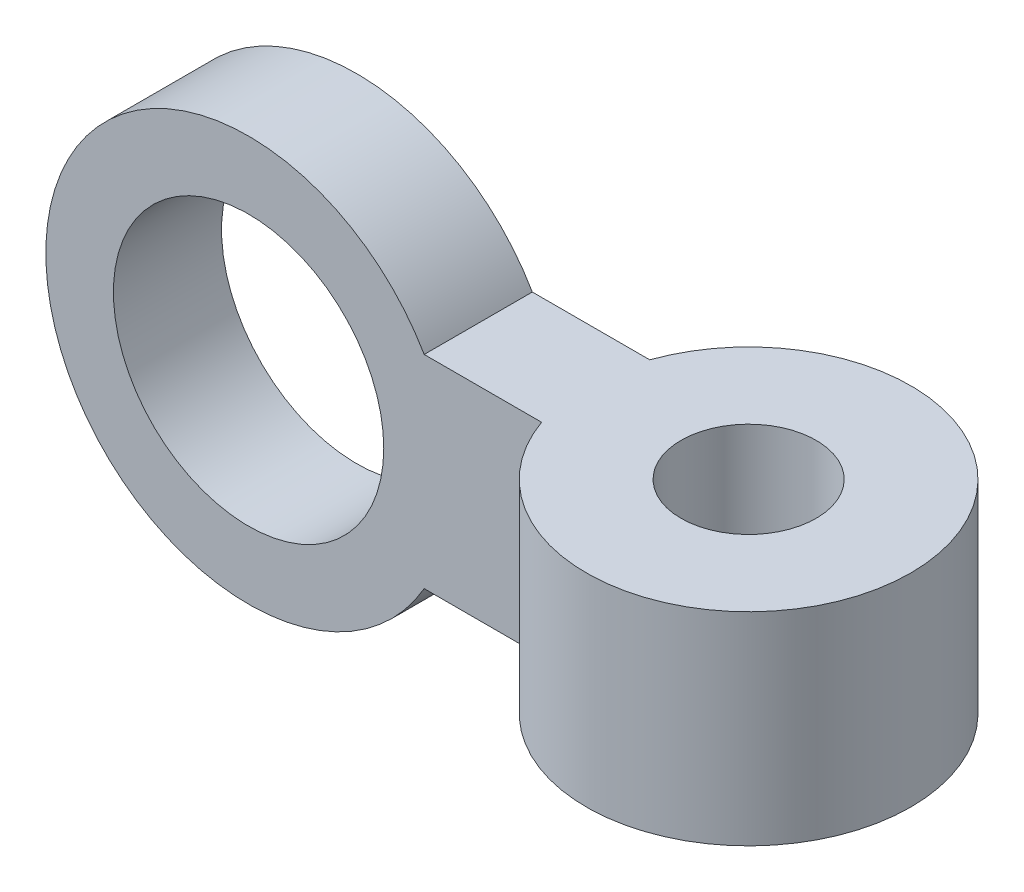
ISO-10303-21;
HEADER;
FILE_DESCRIPTION(('STEP AP214'),'2;1');
FILE_NAME('part.step','',(''),(''),'','','');
FILE_SCHEMA(('AUTOMOTIVE_DESIGN { 1 0 10303 214 1 1 1 1 }'));
ENDSEC;
DATA;
#1=APPLICATION_CONTEXT('core data for automotive mechanical design processes');
#2=APPLICATION_PROTOCOL_DEFINITION('international standard','automotive_design',2000,#1);
#3=PRODUCT_CONTEXT('',#1,'mechanical');
#4=PRODUCT('Part','Part','',(#3));
#5=PRODUCT_RELATED_PRODUCT_CATEGORY('part','',(#4));
#6=PRODUCT_DEFINITION_FORMATION('','',#4);
#7=PRODUCT_DEFINITION_CONTEXT('part definition',#1,'design');
#8=PRODUCT_DEFINITION('design','',#6,#7);
#9=PRODUCT_DEFINITION_SHAPE('','',#8);
#10=(LENGTH_UNIT() NAMED_UNIT(*) SI_UNIT(.MILLI.,.METRE.));
#11=(NAMED_UNIT(*) PLANE_ANGLE_UNIT() SI_UNIT($,.RADIAN.));
#12=(NAMED_UNIT(*) SI_UNIT($,.STERADIAN.) SOLID_ANGLE_UNIT());
#13=UNCERTAINTY_MEASURE_WITH_UNIT(LENGTH_MEASURE(1.E-05),#10,'distance_accuracy_value','');
#14=(GEOMETRIC_REPRESENTATION_CONTEXT(3) GLOBAL_UNCERTAINTY_ASSIGNED_CONTEXT((#13)) GLOBAL_UNIT_ASSIGNED_CONTEXT((#10,
#11,#12)) REPRESENTATION_CONTEXT('',''));
#15=CARTESIAN_POINT('',(0.,0.,0.));
#16=DIRECTION('',(0.,0.,1.));
#17=DIRECTION('',(1.,0.,0.));
#18=AXIS2_PLACEMENT_3D('',#15,#16,#17);
#19=CARTESIAN_POINT('',(0.,0.,8.));
#20=DIRECTION('',(0.,0.,1.));
#21=DIRECTION('',(1.,0.,0.));
#22=AXIS2_PLACEMENT_3D('',#19,#20,#21);
#23=PLANE('',#22);
#24=CARTESIAN_POINT('',(0.,0.,8.));
#25=DIRECTION('',(0.,0.,1.));
#26=DIRECTION('',(1.,0.,0.));
#27=AXIS2_PLACEMENT_3D('',#24,#25,#26);
#28=CIRCLE('',#27,10.);
#29=CARTESIAN_POINT('',(10.,0.,8.));
#30=VERTEX_POINT('',#29);
#31=EDGE_CURVE('E86',#30,#30,#28,.T.);
#32=ORIENTED_EDGE('',*,*,#31,.F.);
#33=EDGE_LOOP('',(#32));
#34=FACE_BOUND('',#33,.T.);
#35=DIRECTION('',(1.,0.,0.));
#36=VECTOR('',#35,1.);
#37=CARTESIAN_POINT('',(12.9903810567666,-7.5,8.));
#38=LINE('',#37,#36);
#39=CARTESIAN_POINT('',(12.9903810567666,-7.5,8.));
#40=VERTEX_POINT('',#39);
#41=CARTESIAN_POINT('',(21.6766725577818,-7.5,8.));
#42=VERTEX_POINT('',#41);
#43=EDGE_CURVE('E94',#40,#42,#38,.T.);
#44=ORIENTED_EDGE('',*,*,#43,.T.);
#45=DIRECTION('',(0.,1.,0.));
#46=VECTOR('',#45,1.);
#47=CARTESIAN_POINT('',(21.6766725577818,-7.5,8.));
#48=LINE('',#47,#46);
#49=CARTESIAN_POINT('',(21.6766725577818,7.5,8.));
#50=VERTEX_POINT('',#49);
#51=EDGE_CURVE('E99',#42,#50,#48,.T.);
#52=ORIENTED_EDGE('',*,*,#51,.T.);
#53=DIRECTION('',(-1.,0.,0.));
#54=VECTOR('',#53,1.);
#55=CARTESIAN_POINT('',(12.9903810567666,7.5,8.));
#56=LINE('',#55,#54);
#57=CARTESIAN_POINT('',(12.9903810567666,7.5,8.));
#58=VERTEX_POINT('',#57);
#59=EDGE_CURVE('E59',#50,#58,#56,.T.);
#60=ORIENTED_EDGE('',*,*,#59,.T.);
#61=CARTESIAN_POINT('',(0.,0.,8.));
#62=DIRECTION('',(0.,0.,1.));
#63=DIRECTION('',(1.,0.,0.));
#64=AXIS2_PLACEMENT_3D('',#61,#62,#63);
#65=CIRCLE('',#64,15.);
#66=EDGE_CURVE('E77',#58,#40,#65,.T.);
#67=ORIENTED_EDGE('',*,*,#66,.T.);
#68=EDGE_LOOP('',(#44,#52,#60,#67));
#69=FACE_BOUND('',#68,.T.);
#70=ADVANCED_FACE('F36',(#34,#69),#23,.T.);
#71=CARTESIAN_POINT('',(0.,0.,0.));
#72=DIRECTION('',(0.,0.,1.));
#73=DIRECTION('',(1.,0.,0.));
#74=AXIS2_PLACEMENT_3D('',#71,#72,#73);
#75=PLANE('',#74);
#76=CARTESIAN_POINT('',(0.,0.,0.));
#77=DIRECTION('',(0.,0.,1.));
#78=DIRECTION('',(1.,0.,0.));
#79=AXIS2_PLACEMENT_3D('',#76,#77,#78);
#80=CIRCLE('',#79,10.);
#81=CARTESIAN_POINT('',(10.,0.,0.));
#82=VERTEX_POINT('',#81);
#83=EDGE_CURVE('E90',#82,#82,#80,.T.);
#84=ORIENTED_EDGE('',*,*,#83,.T.);
#85=EDGE_LOOP('',(#84));
#86=FACE_BOUND('',#85,.T.);
#87=DIRECTION('',(0.,1.,0.));
#88=VECTOR('',#87,1.);
#89=CARTESIAN_POINT('',(21.6766725577818,-7.5,0.));
#90=LINE('',#89,#88);
#91=CARTESIAN_POINT('',(21.6766725577818,-7.5,0.));
#92=VERTEX_POINT('',#91);
#93=CARTESIAN_POINT('',(21.6766725577818,7.5,0.));
#94=VERTEX_POINT('',#93);
#95=EDGE_CURVE('E101',#92,#94,#90,.T.);
#96=ORIENTED_EDGE('',*,*,#95,.F.);
#97=DIRECTION('',(1.,0.,0.));
#98=VECTOR('',#97,1.);
#99=CARTESIAN_POINT('',(12.9903810567666,-7.5,0.));
#100=LINE('',#99,#98);
#101=CARTESIAN_POINT('',(12.9903810567666,-7.5,0.));
#102=VERTEX_POINT('',#101);
#103=EDGE_CURVE('E78',#102,#92,#100,.T.);
#104=ORIENTED_EDGE('',*,*,#103,.F.);
#105=CARTESIAN_POINT('',(0.,0.,0.));
#106=DIRECTION('',(0.,0.,1.));
#107=DIRECTION('',(1.,0.,0.));
#108=AXIS2_PLACEMENT_3D('',#105,#106,#107);
#109=CIRCLE('',#108,15.);
#110=CARTESIAN_POINT('',(12.9903810567666,7.5,0.));
#111=VERTEX_POINT('',#110);
#112=EDGE_CURVE('E83',#111,#102,#109,.T.);
#113=ORIENTED_EDGE('',*,*,#112,.F.);
#114=DIRECTION('',(-1.,0.,0.));
#115=VECTOR('',#114,1.);
#116=CARTESIAN_POINT('',(12.9903810567666,7.5,0.));
#117=LINE('',#116,#115);
#118=EDGE_CURVE('E70',#94,#111,#117,.T.);
#119=ORIENTED_EDGE('',*,*,#118,.F.);
#120=EDGE_LOOP('',(#96,#104,#113,#119));
#121=FACE_BOUND('',#120,.T.);
#122=ADVANCED_FACE('F84',(#86,#121),#75,.F.);
#123=CARTESIAN_POINT('',(0.,0.,8.));
#124=DIRECTION('',(0.,0.,-1.));
#125=DIRECTION('',(-1.,0.,0.));
#126=AXIS2_PLACEMENT_3D('',#123,#124,#125);
#127=CYLINDRICAL_SURFACE('',#126,15.);
#128=ORIENTED_EDGE('',*,*,#112,.T.);
#129=DIRECTION('',(0.,0.,-1.));
#130=VECTOR('',#129,1.);
#131=CARTESIAN_POINT('',(12.9903810567666,-7.5,8.));
#132=LINE('',#131,#130);
#133=EDGE_CURVE('E11',#40,#102,#132,.T.);
#134=ORIENTED_EDGE('',*,*,#133,.F.);
#135=ORIENTED_EDGE('',*,*,#66,.F.);
#136=DIRECTION('',(0.,0.,-1.));
#137=VECTOR('',#136,1.);
#138=CARTESIAN_POINT('',(12.9903810567666,7.5,8.));
#139=LINE('',#138,#137);
#140=EDGE_CURVE('E44',#58,#111,#139,.T.);
#141=ORIENTED_EDGE('',*,*,#140,.T.);
#142=EDGE_LOOP('',(#128,#134,#135,#141));
#143=FACE_BOUND('',#142,.T.);
#144=ADVANCED_FACE('F38',(#143),#127,.T.);
#145=CARTESIAN_POINT('',(12.9903810567666,-7.5,8.));
#146=DIRECTION('',(0.,1.,0.));
#147=DIRECTION('',(0.,0.,1.));
#148=AXIS2_PLACEMENT_3D('',#145,#146,#147);
#149=PLANE('',#148);
#150=CARTESIAN_POINT('',(32.9903810567666,-7.5,4.));
#151=DIRECTION('',(0.,1.,0.));
#152=DIRECTION('',(0.,0.,1.));
#153=AXIS2_PLACEMENT_3D('',#150,#151,#152);
#154=CIRCLE('',#153,5.);
#155=CARTESIAN_POINT('',(32.9903810567666,-7.5,9.));
#156=VERTEX_POINT('',#155);
#157=EDGE_CURVE('E106',#156,#156,#154,.T.);
#158=ORIENTED_EDGE('',*,*,#157,.T.);
#159=EDGE_LOOP('',(#158));
#160=FACE_BOUND('',#159,.T.);
#161=ORIENTED_EDGE('',*,*,#103,.T.);
#162=CARTESIAN_POINT('',(32.9903810567666,-7.5,4.));
#163=DIRECTION('',(0.,1.,0.));
#164=DIRECTION('',(0.,0.,1.));
#165=AXIS2_PLACEMENT_3D('',#162,#163,#164);
#166=CIRCLE('',#165,12.);
#167=EDGE_CURVE('E103',#92,#42,#166,.F.);
#168=ORIENTED_EDGE('',*,*,#167,.T.);
#169=ORIENTED_EDGE('',*,*,#43,.F.);
#170=ORIENTED_EDGE('',*,*,#133,.T.);
#171=EDGE_LOOP('',(#161,#168,#169,#170));
#172=FACE_BOUND('',#171,.T.);
#173=ADVANCED_FACE('F120',(#160,#172),#149,.F.);
#174=CARTESIAN_POINT('',(12.9903810567666,7.5,8.));
#175=DIRECTION('',(0.,-1.,0.));
#176=DIRECTION('',(0.,0.,-1.));
#177=AXIS2_PLACEMENT_3D('',#174,#175,#176);
#178=PLANE('',#177);
#179=CARTESIAN_POINT('',(32.9903810567666,7.5,4.));
#180=DIRECTION('',(0.,1.,0.));
#181=DIRECTION('',(0.,0.,1.));
#182=AXIS2_PLACEMENT_3D('',#179,#180,#181);
#183=CIRCLE('',#182,5.);
#184=CARTESIAN_POINT('',(32.9903810567666,7.5,9.));
#185=VERTEX_POINT('',#184);
#186=EDGE_CURVE('E111',#185,#185,#183,.T.);
#187=ORIENTED_EDGE('',*,*,#186,.F.);
#188=EDGE_LOOP('',(#187));
#189=FACE_BOUND('',#188,.T.);
#190=ORIENTED_EDGE('',*,*,#59,.F.);
#191=CARTESIAN_POINT('',(32.9903810567666,7.5,4.));
#192=DIRECTION('',(0.,1.,0.));
#193=DIRECTION('',(0.,0.,1.));
#194=AXIS2_PLACEMENT_3D('',#191,#192,#193);
#195=CIRCLE('',#194,12.);
#196=EDGE_CURVE('E51',#94,#50,#195,.F.);
#197=ORIENTED_EDGE('',*,*,#196,.F.);
#198=ORIENTED_EDGE('',*,*,#118,.T.);
#199=ORIENTED_EDGE('',*,*,#140,.F.);
#200=EDGE_LOOP('',(#190,#197,#198,#199));
#201=FACE_BOUND('',#200,.T.);
#202=ADVANCED_FACE('F72',(#189,#201),#178,.F.);
#203=CARTESIAN_POINT('',(0.,0.,8.));
#204=DIRECTION('',(0.,0.,-1.));
#205=DIRECTION('',(-1.,0.,0.));
#206=AXIS2_PLACEMENT_3D('',#203,#204,#205);
#207=CYLINDRICAL_SURFACE('',#206,10.);
#208=ORIENTED_EDGE('',*,*,#31,.T.);
#209=EDGE_LOOP('',(#208));
#210=FACE_BOUND('',#209,.T.);
#211=ORIENTED_EDGE('',*,*,#83,.F.);
#212=EDGE_LOOP('',(#211));
#213=FACE_BOUND('',#212,.T.);
#214=ADVANCED_FACE('F119',(#210,#213),#207,.F.);
#215=CARTESIAN_POINT('',(32.9903810567666,-7.5,4.));
#216=DIRECTION('',(0.,1.,0.));
#217=DIRECTION('',(0.,0.,1.));
#218=AXIS2_PLACEMENT_3D('',#215,#216,#217);
#219=CYLINDRICAL_SURFACE('',#218,12.);
#220=ORIENTED_EDGE('',*,*,#196,.T.);
#221=ORIENTED_EDGE('',*,*,#51,.F.);
#222=ORIENTED_EDGE('',*,*,#167,.F.);
#223=ORIENTED_EDGE('',*,*,#95,.T.);
#224=EDGE_LOOP('',(#220,#221,#222,#223));
#225=FACE_BOUND('',#224,.T.);
#226=ADVANCED_FACE('F126',(#225),#219,.T.);
#227=CARTESIAN_POINT('',(32.9903810567666,-15.,4.));
#228=DIRECTION('',(0.,1.,0.));
#229=DIRECTION('',(0.,0.,1.));
#230=AXIS2_PLACEMENT_3D('',#227,#228,#229);
#231=CYLINDRICAL_SURFACE('',#230,5.);
#232=ORIENTED_EDGE('',*,*,#186,.T.);
#233=EDGE_LOOP('',(#232));
#234=FACE_BOUND('',#233,.T.);
#235=ORIENTED_EDGE('',*,*,#157,.F.);
#236=EDGE_LOOP('',(#235));
#237=FACE_BOUND('',#236,.T.);
#238=ADVANCED_FACE('F115',(#234,#237),#231,.F.);
#239=CLOSED_SHELL('',(#70,#122,#144,#173,#202,#214,#226,#238));
#240=MANIFOLD_SOLID_BREP('B2',#239);
#241=ADVANCED_BREP_SHAPE_REPRESENTATION('',(#18,#240),#14);
#242=SHAPE_DEFINITION_REPRESENTATION(#9,#241);
ENDSEC;
END-ISO-10303-21;
